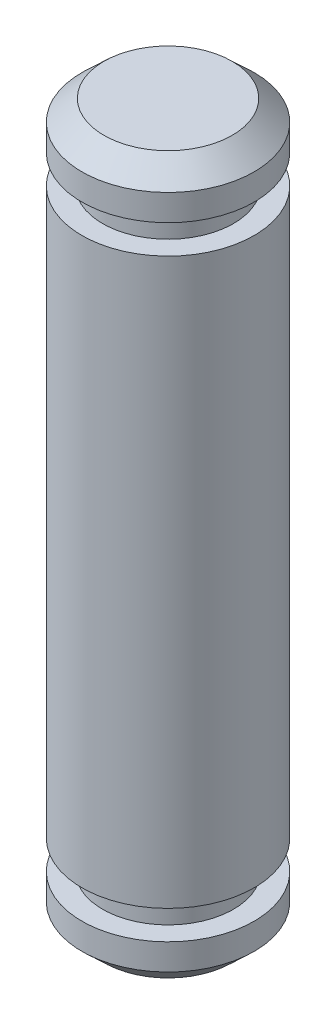
ISO-10303-21;
HEADER;
FILE_DESCRIPTION(('STEP AP214'),'2;1');
FILE_NAME('part.step','',(''),(''),'','','');
FILE_SCHEMA(('AUTOMOTIVE_DESIGN { 1 0 10303 214 1 1 1 1 }'));
ENDSEC;
DATA;
#1=APPLICATION_CONTEXT('core data for automotive mechanical design processes');
#2=APPLICATION_PROTOCOL_DEFINITION('international standard','automotive_design',2000,#1);
#3=PRODUCT_CONTEXT('',#1,'mechanical');
#4=PRODUCT('Part','Part','',(#3));
#5=PRODUCT_RELATED_PRODUCT_CATEGORY('part','',(#4));
#6=PRODUCT_DEFINITION_FORMATION('','',#4);
#7=PRODUCT_DEFINITION_CONTEXT('part definition',#1,'design');
#8=PRODUCT_DEFINITION('design','',#6,#7);
#9=PRODUCT_DEFINITION_SHAPE('','',#8);
#10=(LENGTH_UNIT() NAMED_UNIT(*) SI_UNIT(.MILLI.,.METRE.));
#11=(NAMED_UNIT(*) PLANE_ANGLE_UNIT() SI_UNIT($,.RADIAN.));
#12=(NAMED_UNIT(*) SI_UNIT($,.STERADIAN.) SOLID_ANGLE_UNIT());
#13=UNCERTAINTY_MEASURE_WITH_UNIT(LENGTH_MEASURE(1.E-05),#10,'distance_accuracy_value','');
#14=(GEOMETRIC_REPRESENTATION_CONTEXT(3) GLOBAL_UNCERTAINTY_ASSIGNED_CONTEXT((#13)) GLOBAL_UNIT_ASSIGNED_CONTEXT((#10,
#11,#12)) REPRESENTATION_CONTEXT('',''));
#15=CARTESIAN_POINT('',(0.,0.,0.));
#16=DIRECTION('',(0.,0.,1.));
#17=DIRECTION('',(1.,0.,0.));
#18=AXIS2_PLACEMENT_3D('',#15,#16,#17);
#19=CARTESIAN_POINT('',(-1.5875,5.207,0.));
#20=DIRECTION('',(0.,-1.,0.));
#21=DIRECTION('',(0.,0.,-1.));
#22=AXIS2_PLACEMENT_3D('',#19,#20,#21);
#23=PLANE('',#22);
#24=CARTESIAN_POINT('',(0.,5.207,0.));
#25=DIRECTION('',(0.,-1.,0.));
#26=DIRECTION('',(0.,0.,-1.));
#27=AXIS2_PLACEMENT_3D('',#24,#25,#26);
#28=CIRCLE('',#27,1.5875);
#29=CARTESIAN_POINT('',(0.,5.207,-1.5875));
#30=VERTEX_POINT('',#29);
#31=EDGE_CURVE('E10',#30,#30,#28,.T.);
#32=ORIENTED_EDGE('',*,*,#31,.F.);
#33=EDGE_LOOP('',(#32));
#34=FACE_BOUND('',#33,.T.);
#35=CARTESIAN_POINT('',(0.,5.207,0.));
#36=DIRECTION('',(0.,-1.,0.));
#37=DIRECTION('',(0.,0.,-1.));
#38=AXIS2_PLACEMENT_3D('',#35,#36,#37);
#39=CIRCLE('',#38,1.2065);
#40=CARTESIAN_POINT('',(0.,5.207,-1.2065));
#41=VERTEX_POINT('',#40);
#42=EDGE_CURVE('E72',#41,#41,#39,.T.);
#43=ORIENTED_EDGE('',*,*,#42,.T.);
#44=EDGE_LOOP('',(#43));
#45=FACE_BOUND('',#44,.T.);
#46=ADVANCED_FACE('F32',(#34,#45),#23,.F.);
#47=CARTESIAN_POINT('',(0.,0.,0.));
#48=DIRECTION('',(0.,-1.,0.));
#49=DIRECTION('',(0.,0.,-1.));
#50=AXIS2_PLACEMENT_3D('',#47,#48,#49);
#51=CYLINDRICAL_SURFACE('',#50,1.5875);
#52=CARTESIAN_POINT('',(0.,-5.207,0.));
#53=DIRECTION('',(0.,-1.,0.));
#54=DIRECTION('',(0.,0.,-1.));
#55=AXIS2_PLACEMENT_3D('',#52,#53,#54);
#56=CIRCLE('',#55,1.5875);
#57=CARTESIAN_POINT('',(0.,-5.207,-1.5875));
#58=VERTEX_POINT('',#57);
#59=EDGE_CURVE('E38',#58,#58,#56,.T.);
#60=ORIENTED_EDGE('',*,*,#59,.F.);
#61=EDGE_LOOP('',(#60));
#62=FACE_BOUND('',#61,.T.);
#63=ORIENTED_EDGE('',*,*,#31,.T.);
#64=EDGE_LOOP('',(#63));
#65=FACE_BOUND('',#64,.T.);
#66=ADVANCED_FACE('F112',(#62,#65),#51,.T.);
#67=CARTESIAN_POINT('',(-1.5875,-5.207,0.));
#68=DIRECTION('',(0.,1.,0.));
#69=DIRECTION('',(0.,0.,1.));
#70=AXIS2_PLACEMENT_3D('',#67,#68,#69);
#71=PLANE('',#70);
#72=CARTESIAN_POINT('',(0.,-5.207,0.));
#73=DIRECTION('',(0.,-1.,0.));
#74=DIRECTION('',(0.,0.,-1.));
#75=AXIS2_PLACEMENT_3D('',#72,#73,#74);
#76=CIRCLE('',#75,1.2065);
#77=CARTESIAN_POINT('',(0.,-5.207,-1.2065));
#78=VERTEX_POINT('',#77);
#79=EDGE_CURVE('E42',#78,#78,#76,.T.);
#80=ORIENTED_EDGE('',*,*,#79,.F.);
#81=EDGE_LOOP('',(#80));
#82=FACE_BOUND('',#81,.T.);
#83=ORIENTED_EDGE('',*,*,#59,.T.);
#84=EDGE_LOOP('',(#83));
#85=FACE_BOUND('',#84,.T.);
#86=ADVANCED_FACE('F117',(#82,#85),#71,.F.);
#87=CARTESIAN_POINT('',(0.,0.,0.));
#88=DIRECTION('',(0.,-1.,0.));
#89=DIRECTION('',(0.,0.,-1.));
#90=AXIS2_PLACEMENT_3D('',#87,#88,#89);
#91=CYLINDRICAL_SURFACE('',#90,1.2065);
#92=CARTESIAN_POINT('',(0.,-5.7404,0.));
#93=DIRECTION('',(0.,-1.,0.));
#94=DIRECTION('',(0.,0.,-1.));
#95=AXIS2_PLACEMENT_3D('',#92,#93,#94);
#96=CIRCLE('',#95,1.2065);
#97=CARTESIAN_POINT('',(0.,-5.7404,-1.2065));
#98=VERTEX_POINT('',#97);
#99=EDGE_CURVE('E46',#98,#98,#96,.T.);
#100=ORIENTED_EDGE('',*,*,#99,.F.);
#101=EDGE_LOOP('',(#100));
#102=FACE_BOUND('',#101,.T.);
#103=ORIENTED_EDGE('',*,*,#79,.T.);
#104=EDGE_LOOP('',(#103));
#105=FACE_BOUND('',#104,.T.);
#106=ADVANCED_FACE('F122',(#102,#105),#91,.T.);
#107=CARTESIAN_POINT('',(-1.2065,-5.7404,0.));
#108=DIRECTION('',(0.,-1.,0.));
#109=DIRECTION('',(0.,0.,-1.));
#110=AXIS2_PLACEMENT_3D('',#107,#108,#109);
#111=PLANE('',#110);
#112=CARTESIAN_POINT('',(0.,-5.7404,0.));
#113=DIRECTION('',(0.,-1.,0.));
#114=DIRECTION('',(0.,0.,-1.));
#115=AXIS2_PLACEMENT_3D('',#112,#113,#114);
#116=CIRCLE('',#115,1.5875);
#117=CARTESIAN_POINT('',(0.,-5.7404,-1.5875));
#118=VERTEX_POINT('',#117);
#119=EDGE_CURVE('E51',#118,#118,#116,.T.);
#120=ORIENTED_EDGE('',*,*,#119,.F.);
#121=EDGE_LOOP('',(#120));
#122=FACE_BOUND('',#121,.T.);
#123=ORIENTED_EDGE('',*,*,#99,.T.);
#124=EDGE_LOOP('',(#123));
#125=FACE_BOUND('',#124,.T.);
#126=ADVANCED_FACE('F128',(#122,#125),#111,.F.);
#127=CARTESIAN_POINT('',(0.,0.,0.));
#128=DIRECTION('',(0.,-1.,0.));
#129=DIRECTION('',(0.,0.,-1.));
#130=AXIS2_PLACEMENT_3D('',#127,#128,#129);
#131=CYLINDRICAL_SURFACE('',#130,1.5875);
#132=CARTESIAN_POINT('',(0.,-6.223,0.));
#133=DIRECTION('',(0.,-1.,0.));
#134=DIRECTION('',(0.,0.,-1.));
#135=AXIS2_PLACEMENT_3D('',#132,#133,#134);
#136=CIRCLE('',#135,1.5875);
#137=CARTESIAN_POINT('',(0.,-6.223,-1.5875));
#138=VERTEX_POINT('',#137);
#139=EDGE_CURVE('E54',#138,#138,#136,.T.);
#140=ORIENTED_EDGE('',*,*,#139,.F.);
#141=EDGE_LOOP('',(#140));
#142=FACE_BOUND('',#141,.T.);
#143=ORIENTED_EDGE('',*,*,#119,.T.);
#144=EDGE_LOOP('',(#143));
#145=FACE_BOUND('',#144,.T.);
#146=ADVANCED_FACE('F132',(#142,#145),#131,.T.);
#147=CARTESIAN_POINT('',(0.,-6.223,0.));
#148=DIRECTION('',(0.,1.,0.));
#149=DIRECTION('',(0.,0.,1.));
#150=AXIS2_PLACEMENT_3D('',#147,#148,#149);
#151=CONICAL_SURFACE('',#150,1.5875,0.815568544068997);
#152=CARTESIAN_POINT('',(0.,-6.604,0.));
#153=DIRECTION('',(0.,-1.,0.));
#154=DIRECTION('',(0.,0.,-1.));
#155=AXIS2_PLACEMENT_3D('',#152,#153,#154);
#156=CIRCLE('',#155,1.18278756142947);
#157=CARTESIAN_POINT('',(0.,-6.604,-1.18278756142947));
#158=VERTEX_POINT('',#157);
#159=EDGE_CURVE('E57',#158,#158,#156,.T.);
#160=ORIENTED_EDGE('',*,*,#159,.F.);
#161=EDGE_LOOP('',(#160));
#162=FACE_BOUND('',#161,.T.);
#163=ORIENTED_EDGE('',*,*,#139,.T.);
#164=EDGE_LOOP('',(#163));
#165=FACE_BOUND('',#164,.T.);
#166=ADVANCED_FACE('F108',(#162,#165),#151,.T.);
#167=CARTESIAN_POINT('',(-1.18278756142947,-6.604,0.));
#168=DIRECTION('',(0.,1.,0.));
#169=DIRECTION('',(0.,0.,1.));
#170=AXIS2_PLACEMENT_3D('',#167,#168,#169);
#171=PLANE('',#170);
#172=ORIENTED_EDGE('',*,*,#159,.T.);
#173=EDGE_LOOP('',(#172));
#174=FACE_BOUND('',#173,.T.);
#175=ADVANCED_FACE('F103',(#174),#171,.F.);
#176=CARTESIAN_POINT('',(-1.18278756142947,6.604,0.));
#177=DIRECTION('',(0.,-1.,0.));
#178=DIRECTION('',(0.,0.,-1.));
#179=AXIS2_PLACEMENT_3D('',#176,#177,#178);
#180=PLANE('',#179);
#181=CARTESIAN_POINT('',(0.,6.604,0.));
#182=DIRECTION('',(0.,-1.,0.));
#183=DIRECTION('',(0.,0.,-1.));
#184=AXIS2_PLACEMENT_3D('',#181,#182,#183);
#185=CIRCLE('',#184,1.18278756142947);
#186=CARTESIAN_POINT('',(0.,6.604,-1.18278756142947));
#187=VERTEX_POINT('',#186);
#188=EDGE_CURVE('E60',#187,#187,#185,.T.);
#189=ORIENTED_EDGE('',*,*,#188,.F.);
#190=EDGE_LOOP('',(#189));
#191=FACE_BOUND('',#190,.T.);
#192=ADVANCED_FACE('F98',(#191),#180,.F.);
#193=CARTESIAN_POINT('',(0.,6.604,0.));
#194=DIRECTION('',(0.,-1.,0.));
#195=DIRECTION('',(0.,0.,-1.));
#196=AXIS2_PLACEMENT_3D('',#193,#194,#195);
#197=CONICAL_SURFACE('',#196,1.18278756142947,0.815568544068997);
#198=CARTESIAN_POINT('',(0.,6.223,0.));
#199=DIRECTION('',(0.,-1.,0.));
#200=DIRECTION('',(0.,0.,-1.));
#201=AXIS2_PLACEMENT_3D('',#198,#199,#200);
#202=CIRCLE('',#201,1.5875);
#203=CARTESIAN_POINT('',(0.,6.223,-1.5875));
#204=VERTEX_POINT('',#203);
#205=EDGE_CURVE('E63',#204,#204,#202,.T.);
#206=ORIENTED_EDGE('',*,*,#205,.F.);
#207=EDGE_LOOP('',(#206));
#208=FACE_BOUND('',#207,.T.);
#209=ORIENTED_EDGE('',*,*,#188,.T.);
#210=EDGE_LOOP('',(#209));
#211=FACE_BOUND('',#210,.T.);
#212=ADVANCED_FACE('F92',(#208,#211),#197,.T.);
#213=CARTESIAN_POINT('',(0.,0.,0.));
#214=DIRECTION('',(0.,-1.,0.));
#215=DIRECTION('',(0.,0.,-1.));
#216=AXIS2_PLACEMENT_3D('',#213,#214,#215);
#217=CYLINDRICAL_SURFACE('',#216,1.5875);
#218=CARTESIAN_POINT('',(0.,5.7404,0.));
#219=DIRECTION('',(0.,-1.,0.));
#220=DIRECTION('',(0.,0.,-1.));
#221=AXIS2_PLACEMENT_3D('',#218,#219,#220);
#222=CIRCLE('',#221,1.5875);
#223=CARTESIAN_POINT('',(0.,5.7404,-1.5875));
#224=VERTEX_POINT('',#223);
#225=EDGE_CURVE('E66',#224,#224,#222,.T.);
#226=ORIENTED_EDGE('',*,*,#225,.F.);
#227=EDGE_LOOP('',(#226));
#228=FACE_BOUND('',#227,.T.);
#229=ORIENTED_EDGE('',*,*,#205,.T.);
#230=EDGE_LOOP('',(#229));
#231=FACE_BOUND('',#230,.T.);
#232=ADVANCED_FACE('F86',(#228,#231),#217,.T.);
#233=CARTESIAN_POINT('',(-1.2065,5.7404,0.));
#234=DIRECTION('',(0.,1.,0.));
#235=DIRECTION('',(0.,0.,1.));
#236=AXIS2_PLACEMENT_3D('',#233,#234,#235);
#237=PLANE('',#236);
#238=CARTESIAN_POINT('',(0.,5.7404,0.));
#239=DIRECTION('',(0.,-1.,0.));
#240=DIRECTION('',(0.,0.,-1.));
#241=AXIS2_PLACEMENT_3D('',#238,#239,#240);
#242=CIRCLE('',#241,1.2065);
#243=CARTESIAN_POINT('',(0.,5.7404,-1.2065));
#244=VERTEX_POINT('',#243);
#245=EDGE_CURVE('E69',#244,#244,#242,.T.);
#246=ORIENTED_EDGE('',*,*,#245,.F.);
#247=EDGE_LOOP('',(#246));
#248=FACE_BOUND('',#247,.T.);
#249=ORIENTED_EDGE('',*,*,#225,.T.);
#250=EDGE_LOOP('',(#249));
#251=FACE_BOUND('',#250,.T.);
#252=ADVANCED_FACE('F80',(#248,#251),#237,.F.);
#253=CARTESIAN_POINT('',(0.,0.,0.));
#254=DIRECTION('',(0.,-1.,0.));
#255=DIRECTION('',(0.,0.,-1.));
#256=AXIS2_PLACEMENT_3D('',#253,#254,#255);
#257=CYLINDRICAL_SURFACE('',#256,1.2065);
#258=ORIENTED_EDGE('',*,*,#42,.F.);
#259=EDGE_LOOP('',(#258));
#260=FACE_BOUND('',#259,.T.);
#261=ORIENTED_EDGE('',*,*,#245,.T.);
#262=EDGE_LOOP('',(#261));
#263=FACE_BOUND('',#262,.T.);
#264=ADVANCED_FACE('F77',(#260,#263),#257,.T.);
#265=CLOSED_SHELL('',(#46,#66,#86,#106,#126,#146,#166,#175,#192,#212,#232,#252,#264));
#266=MANIFOLD_SOLID_BREP('B2',#265);
#267=ADVANCED_BREP_SHAPE_REPRESENTATION('',(#18,#266),#14);
#268=SHAPE_DEFINITION_REPRESENTATION(#9,#267);
ENDSEC;
END-ISO-10303-21;
